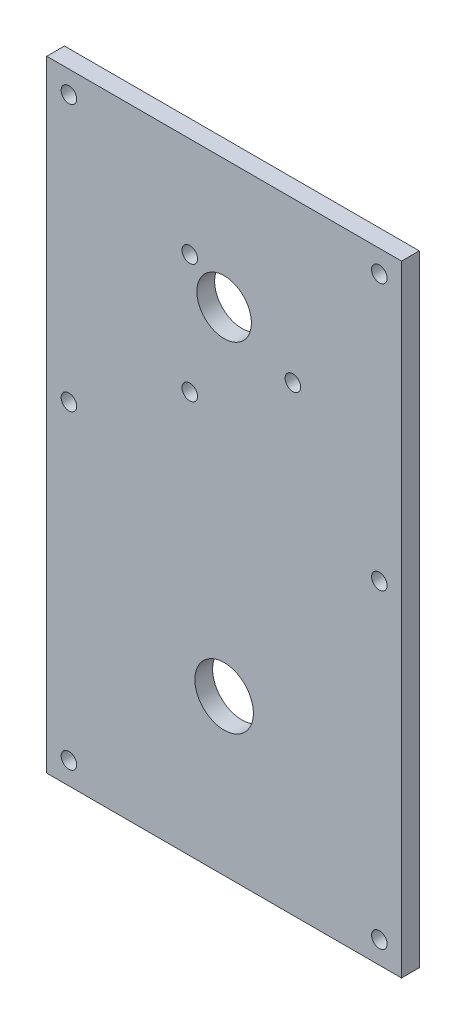
ISO-10303-21;
HEADER;
FILE_DESCRIPTION(('STEP AP214'),'2;1');
FILE_NAME('part.step','',(''),(''),'','','');
FILE_SCHEMA(('AUTOMOTIVE_DESIGN { 1 0 10303 214 1 1 1 1 }'));
ENDSEC;
DATA;
#1=APPLICATION_CONTEXT('core data for automotive mechanical design processes');
#2=APPLICATION_PROTOCOL_DEFINITION('international standard','automotive_design',2000,#1);
#3=PRODUCT_CONTEXT('',#1,'mechanical');
#4=PRODUCT('Part','Part','',(#3));
#5=PRODUCT_RELATED_PRODUCT_CATEGORY('part','',(#4));
#6=PRODUCT_DEFINITION_FORMATION('','',#4);
#7=PRODUCT_DEFINITION_CONTEXT('part definition',#1,'design');
#8=PRODUCT_DEFINITION('design','',#6,#7);
#9=PRODUCT_DEFINITION_SHAPE('','',#8);
#10=(LENGTH_UNIT() NAMED_UNIT(*) SI_UNIT(.MILLI.,.METRE.));
#11=(NAMED_UNIT(*) PLANE_ANGLE_UNIT() SI_UNIT($,.RADIAN.));
#12=(NAMED_UNIT(*) SI_UNIT($,.STERADIAN.) SOLID_ANGLE_UNIT());
#13=UNCERTAINTY_MEASURE_WITH_UNIT(LENGTH_MEASURE(1.E-05),#10,'distance_accuracy_value','');
#14=(GEOMETRIC_REPRESENTATION_CONTEXT(3) GLOBAL_UNCERTAINTY_ASSIGNED_CONTEXT((#13)) GLOBAL_UNIT_ASSIGNED_CONTEXT((#10,
#11,#12)) REPRESENTATION_CONTEXT('',''));
#15=CARTESIAN_POINT('',(0.,0.,0.));
#16=DIRECTION('',(0.,0.,1.));
#17=DIRECTION('',(1.,0.,0.));
#18=AXIS2_PLACEMENT_3D('',#15,#16,#17);
#19=CARTESIAN_POINT('',(0.,0.,4.));
#20=DIRECTION('',(-1.,0.,0.));
#21=DIRECTION('',(0.,-1.,0.));
#22=AXIS2_PLACEMENT_3D('',#19,#20,#21);
#23=PLANE('',#22);
#24=DIRECTION('',(0.,1.,0.));
#25=VECTOR('',#24,1.);
#26=CARTESIAN_POINT('',(0.,0.,0.));
#27=LINE('',#26,#25);
#28=CARTESIAN_POINT('',(0.,0.,0.));
#29=VERTEX_POINT('',#28);
#30=CARTESIAN_POINT('',(0.,140.,0.));
#31=VERTEX_POINT('',#30);
#32=EDGE_CURVE('E120',#29,#31,#27,.T.);
#33=ORIENTED_EDGE('',*,*,#32,.F.);
#34=DIRECTION('',(0.,0.,-1.));
#35=VECTOR('',#34,1.);
#36=CARTESIAN_POINT('',(0.,0.,4.));
#37=LINE('',#36,#35);
#38=CARTESIAN_POINT('',(0.,0.,4.));
#39=VERTEX_POINT('',#38);
#40=EDGE_CURVE('E11',#39,#29,#37,.T.);
#41=ORIENTED_EDGE('',*,*,#40,.F.);
#42=DIRECTION('',(0.,1.,0.));
#43=VECTOR('',#42,1.);
#44=CARTESIAN_POINT('',(0.,0.,4.));
#45=LINE('',#44,#43);
#46=CARTESIAN_POINT('',(0.,140.,4.));
#47=VERTEX_POINT('',#46);
#48=EDGE_CURVE('E91',#39,#47,#45,.T.);
#49=ORIENTED_EDGE('',*,*,#48,.T.);
#50=DIRECTION('',(0.,0.,-1.));
#51=VECTOR('',#50,1.);
#52=CARTESIAN_POINT('',(0.,140.,4.));
#53=LINE('',#52,#51);
#54=EDGE_CURVE('E52',#47,#31,#53,.T.);
#55=ORIENTED_EDGE('',*,*,#54,.T.);
#56=EDGE_LOOP('',(#33,#41,#49,#55));
#57=FACE_BOUND('',#56,.T.);
#58=ADVANCED_FACE('F35',(#57),#23,.T.);
#59=CARTESIAN_POINT('',(0.,0.,4.));
#60=DIRECTION('',(0.,1.,0.));
#61=DIRECTION('',(0.,0.,1.));
#62=AXIS2_PLACEMENT_3D('',#59,#60,#61);
#63=PLANE('',#62);
#64=DIRECTION('',(1.,0.,0.));
#65=VECTOR('',#64,1.);
#66=CARTESIAN_POINT('',(0.,0.,0.));
#67=LINE('',#66,#65);
#68=CARTESIAN_POINT('',(80.,0.,0.));
#69=VERTEX_POINT('',#68);
#70=EDGE_CURVE('E96',#29,#69,#67,.T.);
#71=ORIENTED_EDGE('',*,*,#70,.T.);
#72=DIRECTION('',(0.,0.,-1.));
#73=VECTOR('',#72,1.);
#74=CARTESIAN_POINT('',(80.,0.,4.));
#75=LINE('',#74,#73);
#76=CARTESIAN_POINT('',(80.,0.,4.));
#77=VERTEX_POINT('',#76);
#78=EDGE_CURVE('E44',#77,#69,#75,.T.);
#79=ORIENTED_EDGE('',*,*,#78,.F.);
#80=DIRECTION('',(1.,0.,0.));
#81=VECTOR('',#80,1.);
#82=CARTESIAN_POINT('',(0.,0.,4.));
#83=LINE('',#82,#81);
#84=EDGE_CURVE('E86',#39,#77,#83,.T.);
#85=ORIENTED_EDGE('',*,*,#84,.F.);
#86=ORIENTED_EDGE('',*,*,#40,.T.);
#87=EDGE_LOOP('',(#71,#79,#85,#86));
#88=FACE_BOUND('',#87,.T.);
#89=ADVANCED_FACE('F94',(#88),#63,.F.);
#90=CARTESIAN_POINT('',(80.,0.,4.));
#91=DIRECTION('',(-1.,0.,0.));
#92=DIRECTION('',(0.,0.,1.));
#93=AXIS2_PLACEMENT_3D('',#90,#91,#92);
#94=PLANE('',#93);
#95=DIRECTION('',(0.,1.,0.));
#96=VECTOR('',#95,1.);
#97=CARTESIAN_POINT('',(80.,0.,0.));
#98=LINE('',#97,#96);
#99=CARTESIAN_POINT('',(80.,140.,0.));
#100=VERTEX_POINT('',#99);
#101=EDGE_CURVE('E117',#69,#100,#98,.T.);
#102=ORIENTED_EDGE('',*,*,#101,.T.);
#103=DIRECTION('',(0.,0.,-1.));
#104=VECTOR('',#103,1.);
#105=CARTESIAN_POINT('',(80.,140.,4.));
#106=LINE('',#105,#104);
#107=CARTESIAN_POINT('',(80.,140.,4.));
#108=VERTEX_POINT('',#107);
#109=EDGE_CURVE('E66',#108,#100,#106,.T.);
#110=ORIENTED_EDGE('',*,*,#109,.F.);
#111=DIRECTION('',(0.,1.,0.));
#112=VECTOR('',#111,1.);
#113=CARTESIAN_POINT('',(80.,0.,4.));
#114=LINE('',#113,#112);
#115=EDGE_CURVE('E78',#77,#108,#114,.T.);
#116=ORIENTED_EDGE('',*,*,#115,.F.);
#117=ORIENTED_EDGE('',*,*,#78,.T.);
#118=EDGE_LOOP('',(#102,#110,#116,#117));
#119=FACE_BOUND('',#118,.T.);
#120=ADVANCED_FACE('F80',(#119),#94,.F.);
#121=CARTESIAN_POINT('',(75.,135.,4.));
#122=DIRECTION('',(0.,0.,-1.));
#123=DIRECTION('',(-1.,0.,0.));
#124=AXIS2_PLACEMENT_3D('',#121,#122,#123);
#125=CYLINDRICAL_SURFACE('',#124,1.75);
#126=CARTESIAN_POINT('',(75.,135.,4.));
#127=DIRECTION('',(0.,0.,1.));
#128=DIRECTION('',(1.,0.,0.));
#129=AXIS2_PLACEMENT_3D('',#126,#127,#128);
#130=CIRCLE('',#129,1.75);
#131=CARTESIAN_POINT('',(76.75,135.,4.));
#132=VERTEX_POINT('',#131);
#133=EDGE_CURVE('E145',#132,#132,#130,.T.);
#134=ORIENTED_EDGE('',*,*,#133,.T.);
#135=EDGE_LOOP('',(#134));
#136=FACE_BOUND('',#135,.T.);
#137=CARTESIAN_POINT('',(75.,135.,0.));
#138=DIRECTION('',(0.,0.,1.));
#139=DIRECTION('',(1.,0.,0.));
#140=AXIS2_PLACEMENT_3D('',#137,#138,#139);
#141=CIRCLE('',#140,1.75);
#142=CARTESIAN_POINT('',(76.75,135.,0.));
#143=VERTEX_POINT('',#142);
#144=EDGE_CURVE('E105',#143,#143,#141,.T.);
#145=ORIENTED_EDGE('',*,*,#144,.F.);
#146=EDGE_LOOP('',(#145));
#147=FACE_BOUND('',#146,.T.);
#148=ADVANCED_FACE('F357',(#136,#147),#125,.F.);
#149=CARTESIAN_POINT('',(74.9999999999995,75.,4.));
#150=DIRECTION('',(0.,0.,-1.));
#151=DIRECTION('',(-1.,0.,0.));
#152=AXIS2_PLACEMENT_3D('',#149,#150,#151);
#153=CYLINDRICAL_SURFACE('',#152,1.75);
#154=CARTESIAN_POINT('',(74.9999999999995,75.,4.));
#155=DIRECTION('',(0.,0.,1.));
#156=DIRECTION('',(1.,0.,0.));
#157=AXIS2_PLACEMENT_3D('',#154,#155,#156);
#158=CIRCLE('',#157,1.75);
#159=CARTESIAN_POINT('',(76.7499999999995,75.,4.));
#160=VERTEX_POINT('',#159);
#161=EDGE_CURVE('E148',#160,#160,#158,.T.);
#162=ORIENTED_EDGE('',*,*,#161,.T.);
#163=EDGE_LOOP('',(#162));
#164=FACE_BOUND('',#163,.T.);
#165=CARTESIAN_POINT('',(74.9999999999995,75.,0.));
#166=DIRECTION('',(0.,0.,1.));
#167=DIRECTION('',(1.,0.,0.));
#168=AXIS2_PLACEMENT_3D('',#165,#166,#167);
#169=CIRCLE('',#168,1.75);
#170=CARTESIAN_POINT('',(76.7499999999995,75.,0.));
#171=VERTEX_POINT('',#170);
#172=EDGE_CURVE('E108',#171,#171,#169,.T.);
#173=ORIENTED_EDGE('',*,*,#172,.F.);
#174=EDGE_LOOP('',(#173));
#175=FACE_BOUND('',#174,.T.);
#176=ADVANCED_FACE('F347',(#164,#175),#153,.F.);
#177=CARTESIAN_POINT('',(4.99999999999956,74.9999999999997,4.));
#178=DIRECTION('',(0.,0.,-1.));
#179=DIRECTION('',(-1.,0.,0.));
#180=AXIS2_PLACEMENT_3D('',#177,#178,#179);
#181=CYLINDRICAL_SURFACE('',#180,1.75);
#182=CARTESIAN_POINT('',(4.99999999999956,74.9999999999997,4.));
#183=DIRECTION('',(0.,0.,1.));
#184=DIRECTION('',(1.,0.,0.));
#185=AXIS2_PLACEMENT_3D('',#182,#183,#184);
#186=CIRCLE('',#185,1.75);
#187=CARTESIAN_POINT('',(6.74999999999956,74.9999999999997,4.));
#188=VERTEX_POINT('',#187);
#189=EDGE_CURVE('E151',#188,#188,#186,.T.);
#190=ORIENTED_EDGE('',*,*,#189,.T.);
#191=EDGE_LOOP('',(#190));
#192=FACE_BOUND('',#191,.T.);
#193=CARTESIAN_POINT('',(4.99999999999956,74.9999999999997,0.));
#194=DIRECTION('',(0.,0.,1.));
#195=DIRECTION('',(1.,0.,0.));
#196=AXIS2_PLACEMENT_3D('',#193,#194,#195);
#197=CIRCLE('',#196,1.75);
#198=CARTESIAN_POINT('',(6.74999999999956,74.9999999999997,0.));
#199=VERTEX_POINT('',#198);
#200=EDGE_CURVE('E111',#199,#199,#197,.T.);
#201=ORIENTED_EDGE('',*,*,#200,.F.);
#202=EDGE_LOOP('',(#201));
#203=FACE_BOUND('',#202,.T.);
#204=ADVANCED_FACE('F336',(#192,#203),#181,.F.);
#205=CARTESIAN_POINT('',(0.,140.,4.));
#206=DIRECTION('',(0.,1.,0.));
#207=DIRECTION('',(0.,0.,1.));
#208=AXIS2_PLACEMENT_3D('',#205,#206,#207);
#209=PLANE('',#208);
#210=DIRECTION('',(1.,0.,0.));
#211=VECTOR('',#210,1.);
#212=CARTESIAN_POINT('',(0.,140.,0.));
#213=LINE('',#212,#211);
#214=EDGE_CURVE('E114',#31,#100,#213,.T.);
#215=ORIENTED_EDGE('',*,*,#214,.F.);
#216=ORIENTED_EDGE('',*,*,#54,.F.);
#217=DIRECTION('',(1.,0.,0.));
#218=VECTOR('',#217,1.);
#219=CARTESIAN_POINT('',(0.,140.,4.));
#220=LINE('',#219,#218);
#221=EDGE_CURVE('E85',#47,#108,#220,.T.);
#222=ORIENTED_EDGE('',*,*,#221,.T.);
#223=ORIENTED_EDGE('',*,*,#109,.T.);
#224=EDGE_LOOP('',(#215,#216,#222,#223));
#225=FACE_BOUND('',#224,.T.);
#226=ADVANCED_FACE('F200',(#225),#209,.T.);
#227=CARTESIAN_POINT('',(32.2499999999999,90.5766062413412,4.));
#228=DIRECTION('',(0.,0.,-1.));
#229=DIRECTION('',(-1.,0.,0.));
#230=AXIS2_PLACEMENT_3D('',#227,#228,#229);
#231=CYLINDRICAL_SURFACE('',#230,1.75);
#232=CARTESIAN_POINT('',(32.2499999999999,90.5766062413412,4.));
#233=DIRECTION('',(0.,0.,1.));
#234=DIRECTION('',(1.,0.,0.));
#235=AXIS2_PLACEMENT_3D('',#232,#233,#234);
#236=CIRCLE('',#235,1.75);
#237=CARTESIAN_POINT('',(33.9999999999999,90.5766062413412,4.));
#238=VERTEX_POINT('',#237);
#239=EDGE_CURVE('E156',#238,#238,#236,.T.);
#240=ORIENTED_EDGE('',*,*,#239,.T.);
#241=EDGE_LOOP('',(#240));
#242=FACE_BOUND('',#241,.T.);
#243=CARTESIAN_POINT('',(32.2499999999999,90.5766062413412,0.));
#244=DIRECTION('',(0.,0.,1.));
#245=DIRECTION('',(1.,0.,0.));
#246=AXIS2_PLACEMENT_3D('',#243,#244,#245);
#247=CIRCLE('',#246,1.75);
#248=CARTESIAN_POINT('',(33.9999999999999,90.5766062413412,0.));
#249=VERTEX_POINT('',#248);
#250=EDGE_CURVE('E122',#249,#249,#247,.T.);
#251=ORIENTED_EDGE('',*,*,#250,.F.);
#252=EDGE_LOOP('',(#251));
#253=FACE_BOUND('',#252,.T.);
#254=ADVANCED_FACE('F196',(#242,#253),#231,.F.);
#255=CARTESIAN_POINT('',(40.,35.,4.));
#256=DIRECTION('',(0.,0.,-1.));
#257=DIRECTION('',(-1.,0.,0.));
#258=AXIS2_PLACEMENT_3D('',#255,#256,#257);
#259=CYLINDRICAL_SURFACE('',#258,6.6);
#260=CARTESIAN_POINT('',(40.,35.,4.));
#261=DIRECTION('',(0.,0.,1.));
#262=DIRECTION('',(1.,0.,0.));
#263=AXIS2_PLACEMENT_3D('',#260,#261,#262);
#264=CIRCLE('',#263,6.6);
#265=CARTESIAN_POINT('',(46.6,35.,4.));
#266=VERTEX_POINT('',#265);
#267=EDGE_CURVE('E159',#266,#266,#264,.T.);
#268=ORIENTED_EDGE('',*,*,#267,.T.);
#269=EDGE_LOOP('',(#268));
#270=FACE_BOUND('',#269,.T.);
#271=CARTESIAN_POINT('',(40.,35.,0.));
#272=DIRECTION('',(0.,0.,1.));
#273=DIRECTION('',(1.,0.,0.));
#274=AXIS2_PLACEMENT_3D('',#271,#272,#273);
#275=CIRCLE('',#274,6.6);
#276=CARTESIAN_POINT('',(46.6,35.,0.));
#277=VERTEX_POINT('',#276);
#278=EDGE_CURVE('E125',#277,#277,#275,.T.);
#279=ORIENTED_EDGE('',*,*,#278,.F.);
#280=EDGE_LOOP('',(#279));
#281=FACE_BOUND('',#280,.T.);
#282=ADVANCED_FACE('F199',(#270,#281),#259,.F.);
#283=CARTESIAN_POINT('',(55.5,104.,4.));
#284=DIRECTION('',(0.,0.,-1.));
#285=DIRECTION('',(-1.,0.,0.));
#286=AXIS2_PLACEMENT_3D('',#283,#284,#285);
#287=CYLINDRICAL_SURFACE('',#286,1.75);
#288=CARTESIAN_POINT('',(55.5,104.,4.));
#289=DIRECTION('',(0.,0.,1.));
#290=DIRECTION('',(1.,0.,0.));
#291=AXIS2_PLACEMENT_3D('',#288,#289,#290);
#292=CIRCLE('',#291,1.75);
#293=CARTESIAN_POINT('',(57.25,104.,4.));
#294=VERTEX_POINT('',#293);
#295=EDGE_CURVE('E162',#294,#294,#292,.T.);
#296=ORIENTED_EDGE('',*,*,#295,.T.);
#297=EDGE_LOOP('',(#296));
#298=FACE_BOUND('',#297,.T.);
#299=CARTESIAN_POINT('',(55.5,104.,0.));
#300=DIRECTION('',(0.,0.,1.));
#301=DIRECTION('',(1.,0.,0.));
#302=AXIS2_PLACEMENT_3D('',#299,#300,#301);
#303=CIRCLE('',#302,1.75);
#304=CARTESIAN_POINT('',(57.25,104.,0.));
#305=VERTEX_POINT('',#304);
#306=EDGE_CURVE('E128',#305,#305,#303,.T.);
#307=ORIENTED_EDGE('',*,*,#306,.F.);
#308=EDGE_LOOP('',(#307));
#309=FACE_BOUND('',#308,.T.);
#310=ADVANCED_FACE('F235',(#298,#309),#287,.F.);
#311=CARTESIAN_POINT('',(40.,111.,4.));
#312=DIRECTION('',(0.,0.,-1.));
#313=DIRECTION('',(-1.,0.,0.));
#314=AXIS2_PLACEMENT_3D('',#311,#312,#313);
#315=CYLINDRICAL_SURFACE('',#314,6.15);
#316=CARTESIAN_POINT('',(40.,111.,4.));
#317=DIRECTION('',(0.,0.,1.));
#318=DIRECTION('',(1.,0.,0.));
#319=AXIS2_PLACEMENT_3D('',#316,#317,#318);
#320=CIRCLE('',#319,6.15);
#321=CARTESIAN_POINT('',(46.15,111.,4.));
#322=VERTEX_POINT('',#321);
#323=EDGE_CURVE('E165',#322,#322,#320,.T.);
#324=ORIENTED_EDGE('',*,*,#323,.T.);
#325=EDGE_LOOP('',(#324));
#326=FACE_BOUND('',#325,.T.);
#327=CARTESIAN_POINT('',(40.,111.,0.));
#328=DIRECTION('',(0.,0.,1.));
#329=DIRECTION('',(1.,0.,0.));
#330=AXIS2_PLACEMENT_3D('',#327,#328,#329);
#331=CIRCLE('',#330,6.15);
#332=CARTESIAN_POINT('',(46.15,111.,0.));
#333=VERTEX_POINT('',#332);
#334=EDGE_CURVE('E131',#333,#333,#331,.T.);
#335=ORIENTED_EDGE('',*,*,#334,.F.);
#336=EDGE_LOOP('',(#335));
#337=FACE_BOUND('',#336,.T.);
#338=ADVANCED_FACE('F239',(#326,#337),#315,.F.);
#339=CARTESIAN_POINT('',(32.2499999999999,117.423393758659,4.));
#340=DIRECTION('',(0.,0.,-1.));
#341=DIRECTION('',(-1.,0.,0.));
#342=AXIS2_PLACEMENT_3D('',#339,#340,#341);
#343=CYLINDRICAL_SURFACE('',#342,1.75);
#344=CARTESIAN_POINT('',(32.2499999999999,117.423393758659,4.));
#345=DIRECTION('',(0.,0.,1.));
#346=DIRECTION('',(1.,0.,0.));
#347=AXIS2_PLACEMENT_3D('',#344,#345,#346);
#348=CIRCLE('',#347,1.75);
#349=CARTESIAN_POINT('',(33.9999999999999,117.423393758659,4.));
#350=VERTEX_POINT('',#349);
#351=EDGE_CURVE('E168',#350,#350,#348,.T.);
#352=ORIENTED_EDGE('',*,*,#351,.T.);
#353=EDGE_LOOP('',(#352));
#354=FACE_BOUND('',#353,.T.);
#355=CARTESIAN_POINT('',(32.2499999999999,117.423393758659,0.));
#356=DIRECTION('',(0.,0.,1.));
#357=DIRECTION('',(1.,0.,0.));
#358=AXIS2_PLACEMENT_3D('',#355,#356,#357);
#359=CIRCLE('',#358,1.75);
#360=CARTESIAN_POINT('',(33.9999999999999,117.423393758659,0.));
#361=VERTEX_POINT('',#360);
#362=EDGE_CURVE('E134',#361,#361,#359,.T.);
#363=ORIENTED_EDGE('',*,*,#362,.F.);
#364=EDGE_LOOP('',(#363));
#365=FACE_BOUND('',#364,.T.);
#366=ADVANCED_FACE('F243',(#354,#365),#343,.F.);
#367=CARTESIAN_POINT('',(5.,135.,4.));
#368=DIRECTION('',(0.,0.,-1.));
#369=DIRECTION('',(-1.,0.,0.));
#370=AXIS2_PLACEMENT_3D('',#367,#368,#369);
#371=CYLINDRICAL_SURFACE('',#370,1.75);
#372=CARTESIAN_POINT('',(5.,135.,4.));
#373=DIRECTION('',(0.,0.,1.));
#374=DIRECTION('',(1.,0.,0.));
#375=AXIS2_PLACEMENT_3D('',#372,#373,#374);
#376=CIRCLE('',#375,1.75);
#377=CARTESIAN_POINT('',(6.75,135.,4.));
#378=VERTEX_POINT('',#377);
#379=EDGE_CURVE('E171',#378,#378,#376,.T.);
#380=ORIENTED_EDGE('',*,*,#379,.T.);
#381=EDGE_LOOP('',(#380));
#382=FACE_BOUND('',#381,.T.);
#383=CARTESIAN_POINT('',(5.,135.,0.));
#384=DIRECTION('',(0.,0.,1.));
#385=DIRECTION('',(1.,0.,0.));
#386=AXIS2_PLACEMENT_3D('',#383,#384,#385);
#387=CIRCLE('',#386,1.75);
#388=CARTESIAN_POINT('',(6.75,135.,0.));
#389=VERTEX_POINT('',#388);
#390=EDGE_CURVE('E137',#389,#389,#387,.T.);
#391=ORIENTED_EDGE('',*,*,#390,.F.);
#392=EDGE_LOOP('',(#391));
#393=FACE_BOUND('',#392,.T.);
#394=ADVANCED_FACE('F223',(#382,#393),#371,.F.);
#395=CARTESIAN_POINT('',(75.,5.,4.));
#396=DIRECTION('',(0.,0.,-1.));
#397=DIRECTION('',(-1.,0.,0.));
#398=AXIS2_PLACEMENT_3D('',#395,#396,#397);
#399=CYLINDRICAL_SURFACE('',#398,1.75);
#400=CARTESIAN_POINT('',(75.,5.,4.));
#401=DIRECTION('',(0.,0.,1.));
#402=DIRECTION('',(1.,0.,0.));
#403=AXIS2_PLACEMENT_3D('',#400,#401,#402);
#404=CIRCLE('',#403,1.75);
#405=CARTESIAN_POINT('',(76.75,5.,4.));
#406=VERTEX_POINT('',#405);
#407=EDGE_CURVE('E104',#406,#406,#404,.T.);
#408=ORIENTED_EDGE('',*,*,#407,.T.);
#409=EDGE_LOOP('',(#408));
#410=FACE_BOUND('',#409,.T.);
#411=CARTESIAN_POINT('',(75.,5.,0.));
#412=DIRECTION('',(0.,0.,1.));
#413=DIRECTION('',(1.,0.,0.));
#414=AXIS2_PLACEMENT_3D('',#411,#412,#413);
#415=CIRCLE('',#414,1.75);
#416=CARTESIAN_POINT('',(76.75,5.,0.));
#417=VERTEX_POINT('',#416);
#418=EDGE_CURVE('E140',#417,#417,#415,.T.);
#419=ORIENTED_EDGE('',*,*,#418,.F.);
#420=EDGE_LOOP('',(#419));
#421=FACE_BOUND('',#420,.T.);
#422=ADVANCED_FACE('F37',(#410,#421),#399,.F.);
#423=CARTESIAN_POINT('',(5.,5.,4.));
#424=DIRECTION('',(0.,0.,-1.));
#425=DIRECTION('',(-1.,0.,0.));
#426=AXIS2_PLACEMENT_3D('',#423,#424,#425);
#427=CYLINDRICAL_SURFACE('',#426,1.75);
#428=CARTESIAN_POINT('',(5.,5.,4.));
#429=DIRECTION('',(0.,0.,1.));
#430=DIRECTION('',(1.,0.,0.));
#431=AXIS2_PLACEMENT_3D('',#428,#429,#430);
#432=CIRCLE('',#431,1.75);
#433=CARTESIAN_POINT('',(6.75,5.,4.));
#434=VERTEX_POINT('',#433);
#435=EDGE_CURVE('E100',#434,#434,#432,.T.);
#436=ORIENTED_EDGE('',*,*,#435,.T.);
#437=EDGE_LOOP('',(#436));
#438=FACE_BOUND('',#437,.T.);
#439=CARTESIAN_POINT('',(5.,5.,0.));
#440=DIRECTION('',(0.,0.,1.));
#441=DIRECTION('',(1.,0.,0.));
#442=AXIS2_PLACEMENT_3D('',#439,#440,#441);
#443=CIRCLE('',#442,1.75);
#444=CARTESIAN_POINT('',(6.75,5.,0.));
#445=VERTEX_POINT('',#444);
#446=EDGE_CURVE('E101',#445,#445,#443,.T.);
#447=ORIENTED_EDGE('',*,*,#446,.F.);
#448=EDGE_LOOP('',(#447));
#449=FACE_BOUND('',#448,.T.);
#450=ADVANCED_FACE('F182',(#438,#449),#427,.F.);
#451=CARTESIAN_POINT('',(0.,0.,4.));
#452=DIRECTION('',(0.,0.,1.));
#453=DIRECTION('',(1.,0.,0.));
#454=AXIS2_PLACEMENT_3D('',#451,#452,#453);
#455=PLANE('',#454);
#456=ORIENTED_EDGE('',*,*,#407,.F.);
#457=EDGE_LOOP('',(#456));
#458=FACE_BOUND('',#457,.T.);
#459=ORIENTED_EDGE('',*,*,#379,.F.);
#460=EDGE_LOOP('',(#459));
#461=FACE_BOUND('',#460,.T.);
#462=ORIENTED_EDGE('',*,*,#351,.F.);
#463=EDGE_LOOP('',(#462));
#464=FACE_BOUND('',#463,.T.);
#465=ORIENTED_EDGE('',*,*,#323,.F.);
#466=EDGE_LOOP('',(#465));
#467=FACE_BOUND('',#466,.T.);
#468=ORIENTED_EDGE('',*,*,#295,.F.);
#469=EDGE_LOOP('',(#468));
#470=FACE_BOUND('',#469,.T.);
#471=ORIENTED_EDGE('',*,*,#267,.F.);
#472=EDGE_LOOP('',(#471));
#473=FACE_BOUND('',#472,.T.);
#474=ORIENTED_EDGE('',*,*,#239,.F.);
#475=EDGE_LOOP('',(#474));
#476=FACE_BOUND('',#475,.T.);
#477=ORIENTED_EDGE('',*,*,#48,.F.);
#478=ORIENTED_EDGE('',*,*,#84,.T.);
#479=ORIENTED_EDGE('',*,*,#115,.T.);
#480=ORIENTED_EDGE('',*,*,#221,.F.);
#481=EDGE_LOOP('',(#477,#478,#479,#480));
#482=FACE_BOUND('',#481,.T.);
#483=ORIENTED_EDGE('',*,*,#189,.F.);
#484=EDGE_LOOP('',(#483));
#485=FACE_BOUND('',#484,.T.);
#486=ORIENTED_EDGE('',*,*,#161,.F.);
#487=EDGE_LOOP('',(#486));
#488=FACE_BOUND('',#487,.T.);
#489=ORIENTED_EDGE('',*,*,#133,.F.);
#490=EDGE_LOOP('',(#489));
#491=FACE_BOUND('',#490,.T.);
#492=ORIENTED_EDGE('',*,*,#435,.F.);
#493=EDGE_LOOP('',(#492));
#494=FACE_BOUND('',#493,.T.);
#495=ADVANCED_FACE('F89',(#458,#461,#464,#467,#470,#473,#476,#482,#485,#488,#491,#494),#455,.T.);
#496=CARTESIAN_POINT('',(0.,0.,0.));
#497=DIRECTION('',(0.,0.,1.));
#498=DIRECTION('',(1.,0.,0.));
#499=AXIS2_PLACEMENT_3D('',#496,#497,#498);
#500=PLANE('',#499);
#501=ORIENTED_EDGE('',*,*,#418,.T.);
#502=EDGE_LOOP('',(#501));
#503=FACE_BOUND('',#502,.T.);
#504=ORIENTED_EDGE('',*,*,#390,.T.);
#505=EDGE_LOOP('',(#504));
#506=FACE_BOUND('',#505,.T.);
#507=ORIENTED_EDGE('',*,*,#362,.T.);
#508=EDGE_LOOP('',(#507));
#509=FACE_BOUND('',#508,.T.);
#510=ORIENTED_EDGE('',*,*,#334,.T.);
#511=EDGE_LOOP('',(#510));
#512=FACE_BOUND('',#511,.T.);
#513=ORIENTED_EDGE('',*,*,#306,.T.);
#514=EDGE_LOOP('',(#513));
#515=FACE_BOUND('',#514,.T.);
#516=ORIENTED_EDGE('',*,*,#278,.T.);
#517=EDGE_LOOP('',(#516));
#518=FACE_BOUND('',#517,.T.);
#519=ORIENTED_EDGE('',*,*,#250,.T.);
#520=EDGE_LOOP('',(#519));
#521=FACE_BOUND('',#520,.T.);
#522=ORIENTED_EDGE('',*,*,#32,.T.);
#523=ORIENTED_EDGE('',*,*,#214,.T.);
#524=ORIENTED_EDGE('',*,*,#101,.F.);
#525=ORIENTED_EDGE('',*,*,#70,.F.);
#526=EDGE_LOOP('',(#522,#523,#524,#525));
#527=FACE_BOUND('',#526,.T.);
#528=ORIENTED_EDGE('',*,*,#200,.T.);
#529=EDGE_LOOP('',(#528));
#530=FACE_BOUND('',#529,.T.);
#531=ORIENTED_EDGE('',*,*,#172,.T.);
#532=EDGE_LOOP('',(#531));
#533=FACE_BOUND('',#532,.T.);
#534=ORIENTED_EDGE('',*,*,#144,.T.);
#535=EDGE_LOOP('',(#534));
#536=FACE_BOUND('',#535,.T.);
#537=ORIENTED_EDGE('',*,*,#446,.T.);
#538=EDGE_LOOP('',(#537));
#539=FACE_BOUND('',#538,.T.);
#540=ADVANCED_FACE('F181',(#503,#506,#509,#512,#515,#518,#521,#527,#530,#533,#536,#539),#500,.F.);
#541=CLOSED_SHELL('',(#58,#89,#120,#148,#176,#204,#226,#254,#282,#310,#338,#366,#394,#422,#450,
#495,#540));
#542=MANIFOLD_SOLID_BREP('B2',#541);
#543=ADVANCED_BREP_SHAPE_REPRESENTATION('',(#18,#542),#14);
#544=SHAPE_DEFINITION_REPRESENTATION(#9,#543);
ENDSEC;
END-ISO-10303-21;
